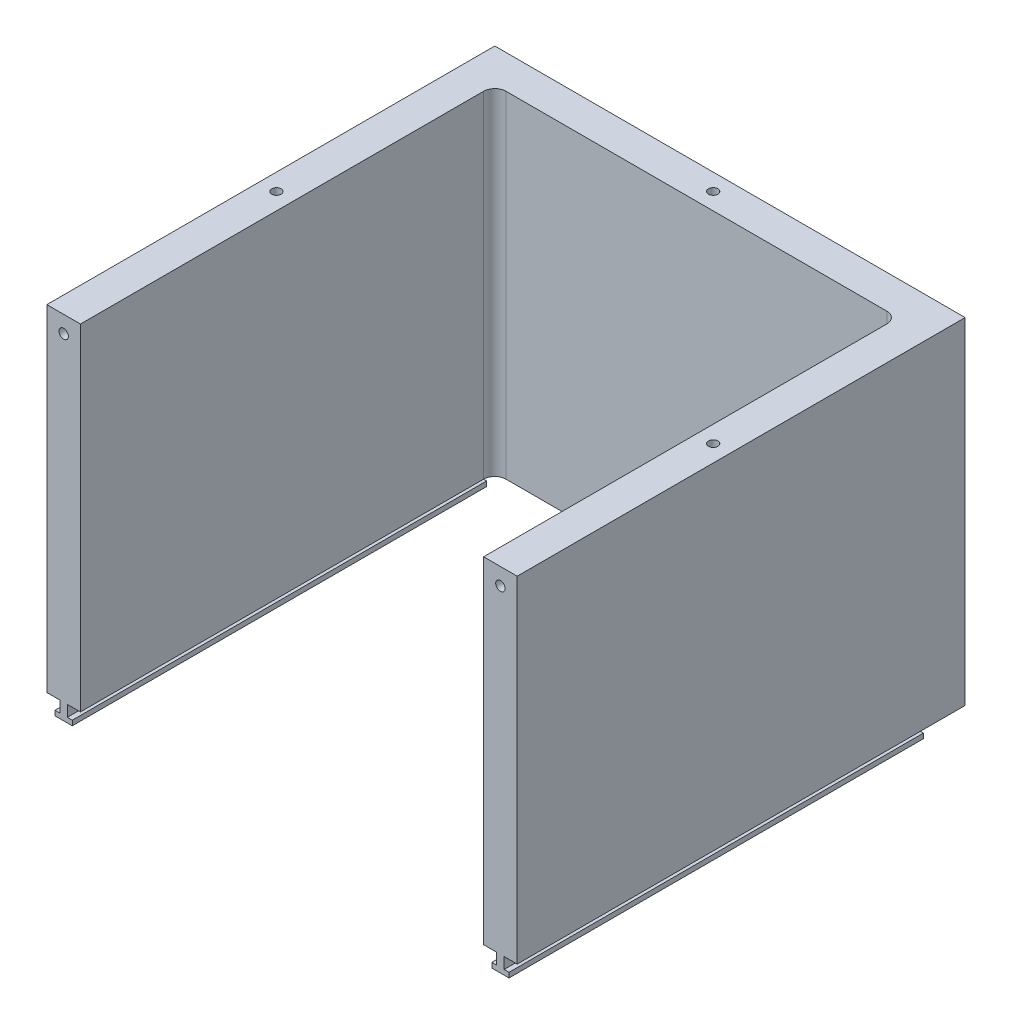
ISO-10303-21;
HEADER;
FILE_DESCRIPTION(('STEP AP214'),'2;1');
FILE_NAME('part.step','',(''),(''),'','','');
FILE_SCHEMA(('AUTOMOTIVE_DESIGN { 1 0 10303 214 1 1 1 1 }'));
ENDSEC;
DATA;
#1=APPLICATION_CONTEXT('core data for automotive mechanical design processes');
#2=APPLICATION_PROTOCOL_DEFINITION('international standard','automotive_design',2000,#1);
#3=PRODUCT_CONTEXT('',#1,'mechanical');
#4=PRODUCT('Part','Part','',(#3));
#5=PRODUCT_RELATED_PRODUCT_CATEGORY('part','',(#4));
#6=PRODUCT_DEFINITION_FORMATION('','',#4);
#7=PRODUCT_DEFINITION_CONTEXT('part definition',#1,'design');
#8=PRODUCT_DEFINITION('design','',#6,#7);
#9=PRODUCT_DEFINITION_SHAPE('','',#8);
#10=(LENGTH_UNIT() NAMED_UNIT(*) SI_UNIT(.MILLI.,.METRE.));
#11=(NAMED_UNIT(*) PLANE_ANGLE_UNIT() SI_UNIT($,.RADIAN.));
#12=(NAMED_UNIT(*) SI_UNIT($,.STERADIAN.) SOLID_ANGLE_UNIT());
#13=UNCERTAINTY_MEASURE_WITH_UNIT(LENGTH_MEASURE(1.E-05),#10,'distance_accuracy_value','');
#14=(GEOMETRIC_REPRESENTATION_CONTEXT(3) GLOBAL_UNCERTAINTY_ASSIGNED_CONTEXT((#13)) GLOBAL_UNIT_ASSIGNED_CONTEXT((#10,
#11,#12)) REPRESENTATION_CONTEXT('',''));
#15=CARTESIAN_POINT('',(0.,0.,0.));
#16=DIRECTION('',(0.,0.,1.));
#17=DIRECTION('',(1.,0.,0.));
#18=AXIS2_PLACEMENT_3D('',#15,#16,#17);
#19=CARTESIAN_POINT('',(0.,75.,0.));
#20=DIRECTION('',(0.,1.,0.));
#21=DIRECTION('',(0.,0.,1.));
#22=AXIS2_PLACEMENT_3D('',#19,#20,#21);
#23=PLANE('',#22);
#24=DIRECTION('',(0.,0.,1.));
#25=VECTOR('',#24,1.);
#26=CARTESIAN_POINT('',(-95.85,75.,-10.5418214744891));
#27=LINE('',#26,#25);
#28=CARTESIAN_POINT('',(-95.85,75.,0.));
#29=VERTEX_POINT('',#28);
#30=CARTESIAN_POINT('',(-95.85,75.,185.));
#31=VERTEX_POINT('',#30);
#32=EDGE_CURVE('E259',#29,#31,#27,.T.);
#33=ORIENTED_EDGE('',*,*,#32,.F.);
#34=DIRECTION('',(-1.,0.,0.));
#35=VECTOR('',#34,1.);
#36=CARTESIAN_POINT('',(-99.1499999999999,75.,0.));
#37=LINE('',#36,#35);
#38=CARTESIAN_POINT('',(-99.1499999999999,75.,0.));
#39=VERTEX_POINT('',#38);
#40=EDGE_CURVE('E256',#29,#39,#37,.T.);
#41=ORIENTED_EDGE('',*,*,#40,.T.);
#42=DIRECTION('',(0.,0.,1.));
#43=VECTOR('',#42,1.);
#44=CARTESIAN_POINT('',(-99.1499999999999,75.,-10.5418214744891));
#45=LINE('',#44,#43);
#46=CARTESIAN_POINT('',(-99.1499999999999,75.,185.));
#47=VERTEX_POINT('',#46);
#48=EDGE_CURVE('E255',#39,#47,#45,.T.);
#49=ORIENTED_EDGE('',*,*,#48,.T.);
#50=DIRECTION('',(1.,0.,0.));
#51=VECTOR('',#50,1.);
#52=CARTESIAN_POINT('',(-90.,75.,185.));
#53=LINE('',#52,#51);
#54=CARTESIAN_POINT('',(-105.,75.,185.));
#55=VERTEX_POINT('',#54);
#56=EDGE_CURVE('E411',#55,#47,#53,.T.);
#57=ORIENTED_EDGE('',*,*,#56,.F.);
#58=DIRECTION('',(0.,0.,1.));
#59=VECTOR('',#58,1.);
#60=CARTESIAN_POINT('',(-105.,75.,185.));
#61=LINE('',#60,#59);
#62=CARTESIAN_POINT('',(-105.,75.,-15.));
#63=VERTEX_POINT('',#62);
#64=EDGE_CURVE('E408',#63,#55,#61,.T.);
#65=ORIENTED_EDGE('',*,*,#64,.F.);
#66=DIRECTION('',(-1.,0.,0.));
#67=VECTOR('',#66,1.);
#68=CARTESIAN_POINT('',(-105.,75.,-15.));
#69=LINE('',#68,#67);
#70=CARTESIAN_POINT('',(105.,75.,-15.));
#71=VERTEX_POINT('',#70);
#72=EDGE_CURVE('E414',#71,#63,#69,.T.);
#73=ORIENTED_EDGE('',*,*,#72,.F.);
#74=DIRECTION('',(0.,0.,-1.));
#75=VECTOR('',#74,1.);
#76=CARTESIAN_POINT('',(105.,75.,-15.));
#77=LINE('',#76,#75);
#78=CARTESIAN_POINT('',(105.,75.,185.));
#79=VERTEX_POINT('',#78);
#80=EDGE_CURVE('E410',#79,#71,#77,.T.);
#81=ORIENTED_EDGE('',*,*,#80,.F.);
#82=CARTESIAN_POINT('',(99.1499999999999,75.,185.));
#83=VERTEX_POINT('',#82);
#84=EDGE_CURVE('E416',#83,#79,#53,.T.);
#85=ORIENTED_EDGE('',*,*,#84,.F.);
#86=DIRECTION('',(0.,0.,1.));
#87=VECTOR('',#86,1.);
#88=CARTESIAN_POINT('',(99.1499999999999,75.,-10.5418214744891));
#89=LINE('',#88,#87);
#90=CARTESIAN_POINT('',(99.1499999999999,75.,0.));
#91=VERTEX_POINT('',#90);
#92=EDGE_CURVE('E289',#91,#83,#89,.T.);
#93=ORIENTED_EDGE('',*,*,#92,.F.);
#94=DIRECTION('',(-1.,0.,0.));
#95=VECTOR('',#94,1.);
#96=CARTESIAN_POINT('',(99.1499999999999,75.,0.));
#97=LINE('',#96,#95);
#98=CARTESIAN_POINT('',(95.85,75.,0.));
#99=VERTEX_POINT('',#98);
#100=EDGE_CURVE('E291',#91,#99,#97,.T.);
#101=ORIENTED_EDGE('',*,*,#100,.T.);
#102=DIRECTION('',(0.,0.,1.));
#103=VECTOR('',#102,1.);
#104=CARTESIAN_POINT('',(95.85,75.,-10.5418214744891));
#105=LINE('',#104,#103);
#106=CARTESIAN_POINT('',(95.85,75.,185.));
#107=VERTEX_POINT('',#106);
#108=EDGE_CURVE('E292',#99,#107,#105,.T.);
#109=ORIENTED_EDGE('',*,*,#108,.T.);
#110=CARTESIAN_POINT('',(90.,75.,185.));
#111=VERTEX_POINT('',#110);
#112=EDGE_CURVE('E417',#111,#107,#53,.T.);
#113=ORIENTED_EDGE('',*,*,#112,.F.);
#114=DIRECTION('',(0.,0.,1.));
#115=VECTOR('',#114,1.);
#116=CARTESIAN_POINT('',(90.,75.,0.));
#117=LINE('',#116,#115);
#118=CARTESIAN_POINT('',(90.,75.,5.));
#119=VERTEX_POINT('',#118);
#120=EDGE_CURVE('E421',#119,#111,#117,.T.);
#121=ORIENTED_EDGE('',*,*,#120,.F.);
#122=CARTESIAN_POINT('',(85.,75.,5.));
#123=DIRECTION('',(0.,1.,0.));
#124=DIRECTION('',(0.,0.,1.));
#125=AXIS2_PLACEMENT_3D('',#122,#123,#124);
#126=CIRCLE('',#125,5.);
#127=CARTESIAN_POINT('',(85.,75.,0.));
#128=VERTEX_POINT('',#127);
#129=EDGE_CURVE('E436',#119,#128,#126,.T.);
#130=ORIENTED_EDGE('',*,*,#129,.T.);
#131=DIRECTION('',(1.,0.,0.));
#132=VECTOR('',#131,1.);
#133=CARTESIAN_POINT('',(-90.,75.,0.));
#134=LINE('',#133,#132);
#135=CARTESIAN_POINT('',(-85.,75.,0.));
#136=VERTEX_POINT('',#135);
#137=EDGE_CURVE('E424',#136,#128,#134,.T.);
#138=ORIENTED_EDGE('',*,*,#137,.F.);
#139=CARTESIAN_POINT('',(-85.,75.,5.));
#140=DIRECTION('',(0.,1.,0.));
#141=DIRECTION('',(0.,0.,1.));
#142=AXIS2_PLACEMENT_3D('',#139,#140,#141);
#143=CIRCLE('',#142,5.);
#144=CARTESIAN_POINT('',(-90.,75.,5.));
#145=VERTEX_POINT('',#144);
#146=EDGE_CURVE('E56',#136,#145,#143,.T.);
#147=ORIENTED_EDGE('',*,*,#146,.T.);
#148=DIRECTION('',(0.,0.,-1.));
#149=VECTOR('',#148,1.);
#150=CARTESIAN_POINT('',(-90.,75.,0.));
#151=LINE('',#150,#149);
#152=CARTESIAN_POINT('',(-90.,75.,185.));
#153=VERTEX_POINT('',#152);
#154=EDGE_CURVE('E422',#153,#145,#151,.T.);
#155=ORIENTED_EDGE('',*,*,#154,.F.);
#156=EDGE_CURVE('E415',#31,#153,#53,.T.);
#157=ORIENTED_EDGE('',*,*,#156,.F.);
#158=EDGE_LOOP('',(#33,#41,#49,#57,#65,#73,#81,#85,#93,#101,#109,#113,#121,#130,#138,#147,#155,#157));
#159=FACE_BOUND('',#158,.T.);
#160=ADVANCED_FACE('F48',(#159),#23,.F.);
#161=CARTESIAN_POINT('',(97.4999999999999,219.,90.));
#162=DIRECTION('',(0.,-1.,0.));
#163=DIRECTION('',(0.,0.,-1.));
#164=AXIS2_PLACEMENT_3D('',#161,#162,#163);
#165=PLANE('',#164);
#166=CARTESIAN_POINT('',(97.4999999999999,219.,90.));
#167=DIRECTION('',(0.,1.,0.));
#168=DIRECTION('',(0.,0.,-1.));
#169=AXIS2_PLACEMENT_3D('',#166,#167,#168);
#170=CIRCLE('',#169,2.09999999999987);
#171=CARTESIAN_POINT('',(97.4999999999999,219.,87.9000000000001));
#172=VERTEX_POINT('',#171);
#173=EDGE_CURVE('E281',#172,#172,#170,.T.);
#174=ORIENTED_EDGE('',*,*,#173,.T.);
#175=EDGE_LOOP('',(#174));
#176=FACE_BOUND('',#175,.T.);
#177=ADVANCED_FACE('F522',(#176),#165,.F.);
#178=CARTESIAN_POINT('',(-97.4999999999999,219.,90.));
#179=DIRECTION('',(0.,1.,0.));
#180=DIRECTION('',(0.,0.,1.));
#181=AXIS2_PLACEMENT_3D('',#178,#179,#180);
#182=PLANE('',#181);
#183=CARTESIAN_POINT('',(-97.4999999999999,219.,90.));
#184=DIRECTION('',(0.,1.,0.));
#185=DIRECTION('',(0.,0.,1.));
#186=AXIS2_PLACEMENT_3D('',#183,#184,#185);
#187=CIRCLE('',#186,2.1);
#188=CARTESIAN_POINT('',(-97.4999999999999,219.,92.1));
#189=VERTEX_POINT('',#188);
#190=EDGE_CURVE('E354',#189,#189,#187,.T.);
#191=ORIENTED_EDGE('',*,*,#190,.T.);
#192=EDGE_LOOP('',(#191));
#193=FACE_BOUND('',#192,.T.);
#194=ADVANCED_FACE('F529',(#193),#182,.T.);
#195=CARTESIAN_POINT('',(0.,219.,-7.50000000000006));
#196=DIRECTION('',(0.,1.,0.));
#197=DIRECTION('',(0.,0.,1.));
#198=AXIS2_PLACEMENT_3D('',#195,#196,#197);
#199=PLANE('',#198);
#200=CARTESIAN_POINT('',(0.,219.,-7.50000000000006));
#201=DIRECTION('',(0.,1.,0.));
#202=DIRECTION('',(0.,0.,1.));
#203=AXIS2_PLACEMENT_3D('',#200,#201,#202);
#204=CIRCLE('',#203,2.1);
#205=CARTESIAN_POINT('',(0.,219.,-5.40000000000006));
#206=VERTEX_POINT('',#205);
#207=EDGE_CURVE('E344',#206,#206,#204,.T.);
#208=ORIENTED_EDGE('',*,*,#207,.T.);
#209=EDGE_LOOP('',(#208));
#210=FACE_BOUND('',#209,.T.);
#211=ADVANCED_FACE('F571',(#210),#199,.T.);
#212=CARTESIAN_POINT('',(-97.4999999999999,217.5,180.5));
#213=DIRECTION('',(0.,0.,1.));
#214=DIRECTION('',(1.,0.,0.));
#215=AXIS2_PLACEMENT_3D('',#212,#213,#214);
#216=PLANE('',#215);
#217=CARTESIAN_POINT('',(-97.4999999999999,217.5,180.5));
#218=DIRECTION('',(0.,0.,1.));
#219=DIRECTION('',(1.,0.,0.));
#220=AXIS2_PLACEMENT_3D('',#217,#218,#219);
#221=CIRCLE('',#220,2.1);
#222=CARTESIAN_POINT('',(-95.3999999999999,217.5,180.5));
#223=VERTEX_POINT('',#222);
#224=EDGE_CURVE('E347',#223,#223,#221,.T.);
#225=ORIENTED_EDGE('',*,*,#224,.T.);
#226=EDGE_LOOP('',(#225));
#227=FACE_BOUND('',#226,.T.);
#228=ADVANCED_FACE('F567',(#227),#216,.T.);
#229=CARTESIAN_POINT('',(97.4999999999999,217.5,180.5));
#230=DIRECTION('',(0.,0.,-1.));
#231=DIRECTION('',(-1.,0.,0.));
#232=AXIS2_PLACEMENT_3D('',#229,#230,#231);
#233=PLANE('',#232);
#234=CARTESIAN_POINT('',(97.4999999999999,217.5,180.5));
#235=DIRECTION('',(0.,0.,-1.));
#236=DIRECTION('',(-1.,0.,0.));
#237=AXIS2_PLACEMENT_3D('',#234,#235,#236);
#238=CIRCLE('',#237,2.1);
#239=CARTESIAN_POINT('',(95.3999999999999,217.5,180.5));
#240=VERTEX_POINT('',#239);
#241=EDGE_CURVE('E366',#240,#240,#238,.T.);
#242=ORIENTED_EDGE('',*,*,#241,.F.);
#243=EDGE_LOOP('',(#242));
#244=FACE_BOUND('',#243,.T.);
#245=ADVANCED_FACE('F565',(#244),#233,.F.);
#246=CARTESIAN_POINT('',(97.4999999999999,219.,90.));
#247=DIRECTION('',(0.,1.,0.));
#248=DIRECTION('',(0.,0.,1.));
#249=AXIS2_PLACEMENT_3D('',#246,#247,#248);
#250=CYLINDRICAL_SURFACE('',#249,2.09999999999987);
#251=ORIENTED_EDGE('',*,*,#173,.F.);
#252=EDGE_LOOP('',(#251));
#253=FACE_BOUND('',#252,.T.);
#254=CARTESIAN_POINT('',(97.4999999999999,225.,90.));
#255=DIRECTION('',(0.,1.,0.));
#256=DIRECTION('',(0.,0.,-1.));
#257=AXIS2_PLACEMENT_3D('',#254,#255,#256);
#258=CIRCLE('',#257,2.09999999999987);
#259=CARTESIAN_POINT('',(97.4999999999999,225.,87.9000000000001));
#260=VERTEX_POINT('',#259);
#261=EDGE_CURVE('E357',#260,#260,#258,.T.);
#262=ORIENTED_EDGE('',*,*,#261,.T.);
#263=EDGE_LOOP('',(#262));
#264=FACE_BOUND('',#263,.T.);
#265=ADVANCED_FACE('F566',(#253,#264),#250,.F.);
#266=CARTESIAN_POINT('',(-97.4999999999999,219.,90.));
#267=DIRECTION('',(0.,1.,0.));
#268=DIRECTION('',(0.,0.,1.));
#269=AXIS2_PLACEMENT_3D('',#266,#267,#268);
#270=CYLINDRICAL_SURFACE('',#269,2.1);
#271=ORIENTED_EDGE('',*,*,#190,.F.);
#272=EDGE_LOOP('',(#271));
#273=FACE_BOUND('',#272,.T.);
#274=CARTESIAN_POINT('',(-97.4999999999999,225.,90.));
#275=DIRECTION('',(0.,1.,0.));
#276=DIRECTION('',(0.,0.,1.));
#277=AXIS2_PLACEMENT_3D('',#274,#275,#276);
#278=CIRCLE('',#277,2.1);
#279=CARTESIAN_POINT('',(-97.4999999999999,225.,92.1));
#280=VERTEX_POINT('',#279);
#281=EDGE_CURVE('E351',#280,#280,#278,.T.);
#282=ORIENTED_EDGE('',*,*,#281,.T.);
#283=EDGE_LOOP('',(#282));
#284=FACE_BOUND('',#283,.T.);
#285=ADVANCED_FACE('F735',(#273,#284),#270,.F.);
#286=CARTESIAN_POINT('',(0.,219.,-7.50000000000006));
#287=DIRECTION('',(0.,1.,0.));
#288=DIRECTION('',(0.,0.,1.));
#289=AXIS2_PLACEMENT_3D('',#286,#287,#288);
#290=CYLINDRICAL_SURFACE('',#289,2.1);
#291=ORIENTED_EDGE('',*,*,#207,.F.);
#292=EDGE_LOOP('',(#291));
#293=FACE_BOUND('',#292,.T.);
#294=CARTESIAN_POINT('',(0.,225.,-7.50000000000006));
#295=DIRECTION('',(0.,1.,0.));
#296=DIRECTION('',(0.,0.,1.));
#297=AXIS2_PLACEMENT_3D('',#294,#295,#296);
#298=CIRCLE('',#297,2.1);
#299=CARTESIAN_POINT('',(0.,225.,-5.40000000000006));
#300=VERTEX_POINT('',#299);
#301=EDGE_CURVE('E348',#300,#300,#298,.T.);
#302=ORIENTED_EDGE('',*,*,#301,.T.);
#303=EDGE_LOOP('',(#302));
#304=FACE_BOUND('',#303,.T.);
#305=ADVANCED_FACE('F559',(#293,#304),#290,.F.);
#306=CARTESIAN_POINT('',(-97.4999999999999,217.5,180.5));
#307=DIRECTION('',(0.,0.,1.));
#308=DIRECTION('',(1.,0.,0.));
#309=AXIS2_PLACEMENT_3D('',#306,#307,#308);
#310=CYLINDRICAL_SURFACE('',#309,2.1);
#311=ORIENTED_EDGE('',*,*,#224,.F.);
#312=EDGE_LOOP('',(#311));
#313=FACE_BOUND('',#312,.T.);
#314=CARTESIAN_POINT('',(-97.4999999999999,217.5,185.));
#315=DIRECTION('',(0.,0.,1.));
#316=DIRECTION('',(1.,0.,0.));
#317=AXIS2_PLACEMENT_3D('',#314,#315,#316);
#318=CIRCLE('',#317,2.1);
#319=CARTESIAN_POINT('',(-95.3999999999999,217.5,185.));
#320=VERTEX_POINT('',#319);
#321=EDGE_CURVE('E369',#320,#320,#318,.T.);
#322=ORIENTED_EDGE('',*,*,#321,.T.);
#323=EDGE_LOOP('',(#322));
#324=FACE_BOUND('',#323,.T.);
#325=ADVANCED_FACE('F551',(#313,#324),#310,.F.);
#326=CARTESIAN_POINT('',(97.4999999999999,217.5,180.5));
#327=DIRECTION('',(0.,0.,1.));
#328=DIRECTION('',(1.,0.,0.));
#329=AXIS2_PLACEMENT_3D('',#326,#327,#328);
#330=CYLINDRICAL_SURFACE('',#329,2.1);
#331=ORIENTED_EDGE('',*,*,#241,.T.);
#332=EDGE_LOOP('',(#331));
#333=FACE_BOUND('',#332,.T.);
#334=CARTESIAN_POINT('',(97.4999999999999,217.5,185.));
#335=DIRECTION('',(0.,0.,-1.));
#336=DIRECTION('',(-1.,0.,0.));
#337=AXIS2_PLACEMENT_3D('',#334,#335,#336);
#338=CIRCLE('',#337,2.1);
#339=CARTESIAN_POINT('',(95.3999999999999,217.5,185.));
#340=VERTEX_POINT('',#339);
#341=EDGE_CURVE('E362',#340,#340,#338,.T.);
#342=ORIENTED_EDGE('',*,*,#341,.F.);
#343=EDGE_LOOP('',(#342));
#344=FACE_BOUND('',#343,.T.);
#345=ADVANCED_FACE('F544',(#333,#344),#330,.F.);
#346=CARTESIAN_POINT('',(-90.,225.,0.));
#347=DIRECTION('',(-1.,0.,0.));
#348=DIRECTION('',(0.,0.,1.));
#349=AXIS2_PLACEMENT_3D('',#346,#347,#348);
#350=PLANE('',#349);
#351=ORIENTED_EDGE('',*,*,#154,.T.);
#352=DIRECTION('',(0.,-1.,0.));
#353=VECTOR('',#352,1.);
#354=CARTESIAN_POINT('',(-90.,225.,5.));
#355=LINE('',#354,#353);
#356=CARTESIAN_POINT('',(-90.,225.,5.));
#357=VERTEX_POINT('',#356);
#358=EDGE_CURVE('E63',#145,#357,#355,.F.);
#359=ORIENTED_EDGE('',*,*,#358,.T.);
#360=DIRECTION('',(0.,0.,-1.));
#361=VECTOR('',#360,1.);
#362=CARTESIAN_POINT('',(-90.,225.,0.));
#363=LINE('',#362,#361);
#364=CARTESIAN_POINT('',(-90.,225.,185.));
#365=VERTEX_POINT('',#364);
#366=EDGE_CURVE('E365',#365,#357,#363,.T.);
#367=ORIENTED_EDGE('',*,*,#366,.F.);
#368=DIRECTION('',(0.,-1.,0.));
#369=VECTOR('',#368,1.);
#370=CARTESIAN_POINT('',(-90.,225.,185.));
#371=LINE('',#370,#369);
#372=EDGE_CURVE('E390',#365,#153,#371,.T.);
#373=ORIENTED_EDGE('',*,*,#372,.T.);
#374=EDGE_LOOP('',(#351,#359,#367,#373));
#375=FACE_BOUND('',#374,.T.);
#376=ADVANCED_FACE('F462',(#375),#350,.F.);
#377=CARTESIAN_POINT('',(0.,225.,0.));
#378=DIRECTION('',(0.,-1.,0.));
#379=DIRECTION('',(0.,0.,-1.));
#380=AXIS2_PLACEMENT_3D('',#377,#378,#379);
#381=PLANE('',#380);
#382=ORIENTED_EDGE('',*,*,#301,.F.);
#383=EDGE_LOOP('',(#382));
#384=FACE_BOUND('',#383,.T.);
#385=ORIENTED_EDGE('',*,*,#281,.F.);
#386=EDGE_LOOP('',(#385));
#387=FACE_BOUND('',#386,.T.);
#388=ORIENTED_EDGE('',*,*,#261,.F.);
#389=EDGE_LOOP('',(#388));
#390=FACE_BOUND('',#389,.T.);
#391=ORIENTED_EDGE('',*,*,#366,.T.);
#392=CARTESIAN_POINT('',(-85.,225.,5.));
#393=DIRECTION('',(0.,-1.,0.));
#394=DIRECTION('',(0.,0.,-1.));
#395=AXIS2_PLACEMENT_3D('',#392,#393,#394);
#396=CIRCLE('',#395,5.);
#397=CARTESIAN_POINT('',(-85.,225.,0.));
#398=VERTEX_POINT('',#397);
#399=EDGE_CURVE('E12',#357,#398,#396,.T.);
#400=ORIENTED_EDGE('',*,*,#399,.T.);
#401=DIRECTION('',(1.,0.,0.));
#402=VECTOR('',#401,1.);
#403=CARTESIAN_POINT('',(-90.,225.,0.));
#404=LINE('',#403,#402);
#405=CARTESIAN_POINT('',(84.9999999999999,225.,0.));
#406=VERTEX_POINT('',#405);
#407=EDGE_CURVE('E375',#398,#406,#404,.T.);
#408=ORIENTED_EDGE('',*,*,#407,.T.);
#409=CARTESIAN_POINT('',(85.,225.,5.));
#410=DIRECTION('',(0.,-1.,0.));
#411=DIRECTION('',(0.,0.,-1.));
#412=AXIS2_PLACEMENT_3D('',#409,#410,#411);
#413=CIRCLE('',#412,5.);
#414=CARTESIAN_POINT('',(90.,225.,5.));
#415=VERTEX_POINT('',#414);
#416=EDGE_CURVE('E438',#406,#415,#413,.T.);
#417=ORIENTED_EDGE('',*,*,#416,.T.);
#418=DIRECTION('',(0.,0.,1.));
#419=VECTOR('',#418,1.);
#420=CARTESIAN_POINT('',(90.,225.,0.));
#421=LINE('',#420,#419);
#422=CARTESIAN_POINT('',(90.,225.,185.));
#423=VERTEX_POINT('',#422);
#424=EDGE_CURVE('E378',#415,#423,#421,.T.);
#425=ORIENTED_EDGE('',*,*,#424,.T.);
#426=DIRECTION('',(1.,0.,0.));
#427=VECTOR('',#426,1.);
#428=CARTESIAN_POINT('',(105.,225.,185.));
#429=LINE('',#428,#427);
#430=CARTESIAN_POINT('',(105.,225.,185.));
#431=VERTEX_POINT('',#430);
#432=EDGE_CURVE('E380',#423,#431,#429,.T.);
#433=ORIENTED_EDGE('',*,*,#432,.T.);
#434=DIRECTION('',(0.,0.,-1.));
#435=VECTOR('',#434,1.);
#436=CARTESIAN_POINT('',(105.,225.,-15.));
#437=LINE('',#436,#435);
#438=CARTESIAN_POINT('',(105.,225.,-15.));
#439=VERTEX_POINT('',#438);
#440=EDGE_CURVE('E382',#431,#439,#437,.T.);
#441=ORIENTED_EDGE('',*,*,#440,.T.);
#442=DIRECTION('',(-1.,0.,0.));
#443=VECTOR('',#442,1.);
#444=CARTESIAN_POINT('',(-105.,225.,-15.));
#445=LINE('',#444,#443);
#446=CARTESIAN_POINT('',(-105.,225.,-15.));
#447=VERTEX_POINT('',#446);
#448=EDGE_CURVE('E384',#439,#447,#445,.T.);
#449=ORIENTED_EDGE('',*,*,#448,.T.);
#450=DIRECTION('',(0.,0.,1.));
#451=VECTOR('',#450,1.);
#452=CARTESIAN_POINT('',(-105.,225.,185.));
#453=LINE('',#452,#451);
#454=CARTESIAN_POINT('',(-105.,225.,185.));
#455=VERTEX_POINT('',#454);
#456=EDGE_CURVE('E386',#447,#455,#453,.T.);
#457=ORIENTED_EDGE('',*,*,#456,.T.);
#458=DIRECTION('',(1.,0.,0.));
#459=VECTOR('',#458,1.);
#460=CARTESIAN_POINT('',(-90.,225.,185.));
#461=LINE('',#460,#459);
#462=EDGE_CURVE('E388',#455,#365,#461,.T.);
#463=ORIENTED_EDGE('',*,*,#462,.T.);
#464=EDGE_LOOP('',(#391,#400,#408,#417,#425,#433,#441,#449,#457,#463));
#465=FACE_BOUND('',#464,.T.);
#466=ADVANCED_FACE('F442',(#384,#387,#390,#465),#381,.F.);
#467=CARTESIAN_POINT('',(-90.,225.,185.));
#468=DIRECTION('',(0.,0.,-1.));
#469=DIRECTION('',(-1.,0.,0.));
#470=AXIS2_PLACEMENT_3D('',#467,#468,#469);
#471=PLANE('',#470);
#472=ORIENTED_EDGE('',*,*,#321,.F.);
#473=EDGE_LOOP('',(#472));
#474=FACE_BOUND('',#473,.T.);
#475=DIRECTION('',(0.,-1.,0.));
#476=VECTOR('',#475,1.);
#477=CARTESIAN_POINT('',(-105.,225.,185.));
#478=LINE('',#477,#476);
#479=EDGE_CURVE('E393',#455,#55,#478,.T.);
#480=ORIENTED_EDGE('',*,*,#479,.T.);
#481=ORIENTED_EDGE('',*,*,#56,.T.);
#482=DIRECTION('',(0.,-1.,0.));
#483=VECTOR('',#482,1.);
#484=CARTESIAN_POINT('',(-99.1499999999999,70.,185.));
#485=LINE('',#484,#483);
#486=CARTESIAN_POINT('',(-99.1499999999999,70.,185.));
#487=VERTEX_POINT('',#486);
#488=EDGE_CURVE('E251',#47,#487,#485,.T.);
#489=ORIENTED_EDGE('',*,*,#488,.T.);
#490=DIRECTION('',(-1.,0.,0.));
#491=VECTOR('',#490,1.);
#492=CARTESIAN_POINT('',(-101.35,70.,185.));
#493=LINE('',#492,#491);
#494=CARTESIAN_POINT('',(-101.35,70.,185.));
#495=VERTEX_POINT('',#494);
#496=EDGE_CURVE('E594',#487,#495,#493,.T.);
#497=ORIENTED_EDGE('',*,*,#496,.T.);
#498=DIRECTION('',(0.,-1.,0.));
#499=VECTOR('',#498,1.);
#500=CARTESIAN_POINT('',(-101.35,67.8,185.));
#501=LINE('',#500,#499);
#502=CARTESIAN_POINT('',(-101.35,67.8,185.));
#503=VERTEX_POINT('',#502);
#504=EDGE_CURVE('E236',#495,#503,#501,.T.);
#505=ORIENTED_EDGE('',*,*,#504,.T.);
#506=DIRECTION('',(1.,0.,0.));
#507=VECTOR('',#506,1.);
#508=CARTESIAN_POINT('',(-93.6499999999999,67.8,185.));
#509=LINE('',#508,#507);
#510=CARTESIAN_POINT('',(-93.6499999999999,67.8,185.));
#511=VERTEX_POINT('',#510);
#512=EDGE_CURVE('E595',#503,#511,#509,.T.);
#513=ORIENTED_EDGE('',*,*,#512,.T.);
#514=DIRECTION('',(0.,1.,0.));
#515=VECTOR('',#514,1.);
#516=CARTESIAN_POINT('',(-93.6499999999999,70.,185.));
#517=LINE('',#516,#515);
#518=CARTESIAN_POINT('',(-93.6499999999999,70.,185.));
#519=VERTEX_POINT('',#518);
#520=EDGE_CURVE('E600',#511,#519,#517,.T.);
#521=ORIENTED_EDGE('',*,*,#520,.T.);
#522=DIRECTION('',(-1.,0.,0.));
#523=VECTOR('',#522,1.);
#524=CARTESIAN_POINT('',(-95.85,70.,185.));
#525=LINE('',#524,#523);
#526=CARTESIAN_POINT('',(-95.85,70.,185.));
#527=VERTEX_POINT('',#526);
#528=EDGE_CURVE('E247',#519,#527,#525,.T.);
#529=ORIENTED_EDGE('',*,*,#528,.T.);
#530=DIRECTION('',(0.,1.,0.));
#531=VECTOR('',#530,1.);
#532=CARTESIAN_POINT('',(-95.85,75.,185.));
#533=LINE('',#532,#531);
#534=EDGE_CURVE('E244',#527,#31,#533,.T.);
#535=ORIENTED_EDGE('',*,*,#534,.T.);
#536=ORIENTED_EDGE('',*,*,#156,.T.);
#537=ORIENTED_EDGE('',*,*,#372,.F.);
#538=ORIENTED_EDGE('',*,*,#462,.F.);
#539=EDGE_LOOP('',(#480,#481,#489,#497,#505,#513,#521,#529,#535,#536,#537,#538));
#540=FACE_BOUND('',#539,.T.);
#541=ADVANCED_FACE('F464',(#474,#540),#471,.F.);
#542=CARTESIAN_POINT('',(-105.,225.,-15.));
#543=DIRECTION('',(0.,0.,1.));
#544=DIRECTION('',(1.,0.,0.));
#545=AXIS2_PLACEMENT_3D('',#542,#543,#544);
#546=PLANE('',#545);
#547=DIRECTION('',(0.,-1.,0.));
#548=VECTOR('',#547,1.);
#549=CARTESIAN_POINT('',(105.,225.,-15.));
#550=LINE('',#549,#548);
#551=EDGE_CURVE('E399',#439,#71,#550,.T.);
#552=ORIENTED_EDGE('',*,*,#551,.T.);
#553=ORIENTED_EDGE('',*,*,#72,.T.);
#554=DIRECTION('',(0.,-1.,0.));
#555=VECTOR('',#554,1.);
#556=CARTESIAN_POINT('',(-105.,225.,-15.));
#557=LINE('',#556,#555);
#558=EDGE_CURVE('E396',#447,#63,#557,.T.);
#559=ORIENTED_EDGE('',*,*,#558,.F.);
#560=ORIENTED_EDGE('',*,*,#448,.F.);
#561=EDGE_LOOP('',(#552,#553,#559,#560));
#562=FACE_BOUND('',#561,.T.);
#563=ADVANCED_FACE('F578',(#562),#546,.F.);
#564=CARTESIAN_POINT('',(-105.,225.,185.));
#565=DIRECTION('',(1.,0.,0.));
#566=DIRECTION('',(0.,0.,-1.));
#567=AXIS2_PLACEMENT_3D('',#564,#565,#566);
#568=PLANE('',#567);
#569=ORIENTED_EDGE('',*,*,#558,.T.);
#570=ORIENTED_EDGE('',*,*,#64,.T.);
#571=ORIENTED_EDGE('',*,*,#479,.F.);
#572=ORIENTED_EDGE('',*,*,#456,.F.);
#573=EDGE_LOOP('',(#569,#570,#571,#572));
#574=FACE_BOUND('',#573,.T.);
#575=ADVANCED_FACE('F576',(#574),#568,.F.);
#576=DIRECTION('',(0.,-1.,0.));
#577=VECTOR('',#576,1.);
#578=CARTESIAN_POINT('',(90.,225.,185.));
#579=LINE('',#578,#577);
#580=EDGE_CURVE('E405',#423,#111,#579,.T.);
#581=ORIENTED_EDGE('',*,*,#580,.T.);
#582=ORIENTED_EDGE('',*,*,#112,.T.);
#583=DIRECTION('',(0.,-1.,0.));
#584=VECTOR('',#583,1.);
#585=CARTESIAN_POINT('',(95.85,75.,185.));
#586=LINE('',#585,#584);
#587=CARTESIAN_POINT('',(95.85,70.,185.));
#588=VERTEX_POINT('',#587);
#589=EDGE_CURVE('E333',#107,#588,#586,.T.);
#590=ORIENTED_EDGE('',*,*,#589,.T.);
#591=DIRECTION('',(-1.,0.,0.));
#592=VECTOR('',#591,1.);
#593=CARTESIAN_POINT('',(95.85,70.,185.));
#594=LINE('',#593,#592);
#595=CARTESIAN_POINT('',(93.6499999999999,70.,185.));
#596=VERTEX_POINT('',#595);
#597=EDGE_CURVE('E336',#588,#596,#594,.T.);
#598=ORIENTED_EDGE('',*,*,#597,.T.);
#599=DIRECTION('',(0.,-1.,0.));
#600=VECTOR('',#599,1.);
#601=CARTESIAN_POINT('',(93.6499999999999,70.,185.));
#602=LINE('',#601,#600);
#603=CARTESIAN_POINT('',(93.6499999999999,67.8,185.));
#604=VERTEX_POINT('',#603);
#605=EDGE_CURVE('E339',#596,#604,#602,.T.);
#606=ORIENTED_EDGE('',*,*,#605,.T.);
#607=DIRECTION('',(1.,0.,0.));
#608=VECTOR('',#607,1.);
#609=CARTESIAN_POINT('',(93.6499999999999,67.8,185.));
#610=LINE('',#609,#608);
#611=CARTESIAN_POINT('',(101.35,67.8,185.));
#612=VERTEX_POINT('',#611);
#613=EDGE_CURVE('E323',#604,#612,#610,.T.);
#614=ORIENTED_EDGE('',*,*,#613,.T.);
#615=DIRECTION('',(0.,1.,0.));
#616=VECTOR('',#615,1.);
#617=CARTESIAN_POINT('',(101.35,67.8,185.));
#618=LINE('',#617,#616);
#619=CARTESIAN_POINT('',(101.35,70.,185.));
#620=VERTEX_POINT('',#619);
#621=EDGE_CURVE('E324',#612,#620,#618,.T.);
#622=ORIENTED_EDGE('',*,*,#621,.T.);
#623=DIRECTION('',(-1.,0.,0.));
#624=VECTOR('',#623,1.);
#625=CARTESIAN_POINT('',(101.35,70.,185.));
#626=LINE('',#625,#624);
#627=CARTESIAN_POINT('',(99.1499999999999,70.,185.));
#628=VERTEX_POINT('',#627);
#629=EDGE_CURVE('E327',#620,#628,#626,.T.);
#630=ORIENTED_EDGE('',*,*,#629,.T.);
#631=DIRECTION('',(0.,1.,0.));
#632=VECTOR('',#631,1.);
#633=CARTESIAN_POINT('',(99.1499999999999,70.,185.));
#634=LINE('',#633,#632);
#635=EDGE_CURVE('E330',#628,#83,#634,.T.);
#636=ORIENTED_EDGE('',*,*,#635,.T.);
#637=ORIENTED_EDGE('',*,*,#84,.T.);
#638=DIRECTION('',(0.,-1.,0.));
#639=VECTOR('',#638,1.);
#640=CARTESIAN_POINT('',(105.,225.,185.));
#641=LINE('',#640,#639);
#642=EDGE_CURVE('E402',#431,#79,#641,.T.);
#643=ORIENTED_EDGE('',*,*,#642,.F.);
#644=ORIENTED_EDGE('',*,*,#432,.F.);
#645=EDGE_LOOP('',(#581,#582,#590,#598,#606,#614,#622,#630,#636,#637,#643,#644));
#646=FACE_BOUND('',#645,.T.);
#647=ORIENTED_EDGE('',*,*,#341,.T.);
#648=EDGE_LOOP('',(#647));
#649=FACE_BOUND('',#648,.T.);
#650=ADVANCED_FACE('F473',(#646,#649),#471,.F.);
#651=CARTESIAN_POINT('',(105.,225.,-15.));
#652=DIRECTION('',(-1.,0.,0.));
#653=DIRECTION('',(0.,0.,1.));
#654=AXIS2_PLACEMENT_3D('',#651,#652,#653);
#655=PLANE('',#654);
#656=ORIENTED_EDGE('',*,*,#642,.T.);
#657=ORIENTED_EDGE('',*,*,#80,.T.);
#658=ORIENTED_EDGE('',*,*,#551,.F.);
#659=ORIENTED_EDGE('',*,*,#440,.F.);
#660=EDGE_LOOP('',(#656,#657,#658,#659));
#661=FACE_BOUND('',#660,.T.);
#662=ADVANCED_FACE('F482',(#661),#655,.F.);
#663=CARTESIAN_POINT('',(-90.,225.,0.));
#664=DIRECTION('',(0.,0.,-1.));
#665=DIRECTION('',(-1.,0.,0.));
#666=AXIS2_PLACEMENT_3D('',#663,#664,#665);
#667=PLANE('',#666);
#668=ORIENTED_EDGE('',*,*,#137,.T.);
#669=DIRECTION('',(0.,-1.,0.));
#670=VECTOR('',#669,1.);
#671=CARTESIAN_POINT('',(85.,225.,0.));
#672=LINE('',#671,#670);
#673=EDGE_CURVE('E433',#128,#406,#672,.F.);
#674=ORIENTED_EDGE('',*,*,#673,.T.);
#675=ORIENTED_EDGE('',*,*,#407,.F.);
#676=DIRECTION('',(0.,-1.,0.));
#677=VECTOR('',#676,1.);
#678=CARTESIAN_POINT('',(-85.,75.,0.));
#679=LINE('',#678,#677);
#680=EDGE_CURVE('E430',#398,#136,#679,.T.);
#681=ORIENTED_EDGE('',*,*,#680,.T.);
#682=EDGE_LOOP('',(#668,#674,#675,#681));
#683=FACE_BOUND('',#682,.T.);
#684=ADVANCED_FACE('F456',(#683),#667,.F.);
#685=CARTESIAN_POINT('',(90.,225.,0.));
#686=DIRECTION('',(1.,0.,0.));
#687=DIRECTION('',(0.,0.,-1.));
#688=AXIS2_PLACEMENT_3D('',#685,#686,#687);
#689=PLANE('',#688);
#690=ORIENTED_EDGE('',*,*,#424,.F.);
#691=DIRECTION('',(0.,-1.,0.));
#692=VECTOR('',#691,1.);
#693=CARTESIAN_POINT('',(90.,75.,5.));
#694=LINE('',#693,#692);
#695=EDGE_CURVE('E419',#415,#119,#694,.T.);
#696=ORIENTED_EDGE('',*,*,#695,.T.);
#697=ORIENTED_EDGE('',*,*,#120,.T.);
#698=ORIENTED_EDGE('',*,*,#580,.F.);
#699=EDGE_LOOP('',(#690,#696,#697,#698));
#700=FACE_BOUND('',#699,.T.);
#701=ADVANCED_FACE('F449',(#700),#689,.F.);
#702=CARTESIAN_POINT('',(-90.,225.,0.));
#703=DIRECTION('',(0.,0.,-1.));
#704=DIRECTION('',(-1.,0.,0.));
#705=AXIS2_PLACEMENT_3D('',#702,#703,#704);
#706=PLANE('',#705);
#707=DIRECTION('',(0.,1.,0.));
#708=VECTOR('',#707,1.);
#709=CARTESIAN_POINT('',(101.35,67.8,0.));
#710=LINE('',#709,#708);
#711=CARTESIAN_POINT('',(101.35,67.8,0.));
#712=VERTEX_POINT('',#711);
#713=CARTESIAN_POINT('',(101.35,70.,0.));
#714=VERTEX_POINT('',#713);
#715=EDGE_CURVE('E284',#712,#714,#710,.T.);
#716=ORIENTED_EDGE('',*,*,#715,.F.);
#717=DIRECTION('',(1.,0.,0.));
#718=VECTOR('',#717,1.);
#719=CARTESIAN_POINT('',(93.6499999999999,67.8,0.));
#720=LINE('',#719,#718);
#721=CARTESIAN_POINT('',(93.6499999999999,67.8,0.));
#722=VERTEX_POINT('',#721);
#723=EDGE_CURVE('E304',#722,#712,#720,.T.);
#724=ORIENTED_EDGE('',*,*,#723,.F.);
#725=DIRECTION('',(0.,-1.,0.));
#726=VECTOR('',#725,1.);
#727=CARTESIAN_POINT('',(93.6499999999999,70.,0.));
#728=LINE('',#727,#726);
#729=CARTESIAN_POINT('',(93.6499999999999,70.,0.));
#730=VERTEX_POINT('',#729);
#731=EDGE_CURVE('E301',#730,#722,#728,.T.);
#732=ORIENTED_EDGE('',*,*,#731,.F.);
#733=DIRECTION('',(-1.,0.,0.));
#734=VECTOR('',#733,1.);
#735=CARTESIAN_POINT('',(95.85,70.,0.));
#736=LINE('',#735,#734);
#737=CARTESIAN_POINT('',(95.85,70.,0.));
#738=VERTEX_POINT('',#737);
#739=EDGE_CURVE('E298',#738,#730,#736,.T.);
#740=ORIENTED_EDGE('',*,*,#739,.F.);
#741=DIRECTION('',(0.,-1.,0.));
#742=VECTOR('',#741,1.);
#743=CARTESIAN_POINT('',(95.85,75.,0.));
#744=LINE('',#743,#742);
#745=EDGE_CURVE('E295',#99,#738,#744,.T.);
#746=ORIENTED_EDGE('',*,*,#745,.F.);
#747=ORIENTED_EDGE('',*,*,#100,.F.);
#748=DIRECTION('',(0.,1.,0.));
#749=VECTOR('',#748,1.);
#750=CARTESIAN_POINT('',(99.1499999999999,70.,0.));
#751=LINE('',#750,#749);
#752=CARTESIAN_POINT('',(99.1499999999999,70.,0.));
#753=VERTEX_POINT('',#752);
#754=EDGE_CURVE('E288',#753,#91,#751,.T.);
#755=ORIENTED_EDGE('',*,*,#754,.F.);
#756=DIRECTION('',(-1.,0.,0.));
#757=VECTOR('',#756,1.);
#758=CARTESIAN_POINT('',(101.35,70.,0.));
#759=LINE('',#758,#757);
#760=EDGE_CURVE('E287',#714,#753,#759,.T.);
#761=ORIENTED_EDGE('',*,*,#760,.F.);
#762=EDGE_LOOP('',(#716,#724,#732,#740,#746,#747,#755,#761));
#763=FACE_BOUND('',#762,.T.);
#764=ADVANCED_FACE('F511',(#763),#706,.T.);
#765=CARTESIAN_POINT('',(101.35,70.,-10.5418214744891));
#766=DIRECTION('',(0.,1.,0.));
#767=DIRECTION('',(0.,0.,1.));
#768=AXIS2_PLACEMENT_3D('',#765,#766,#767);
#769=PLANE('',#768);
#770=DIRECTION('',(0.,0.,1.));
#771=VECTOR('',#770,1.);
#772=CARTESIAN_POINT('',(101.35,70.,-10.5418214744891));
#773=LINE('',#772,#771);
#774=EDGE_CURVE('E282',#714,#620,#773,.T.);
#775=ORIENTED_EDGE('',*,*,#774,.F.);
#776=ORIENTED_EDGE('',*,*,#760,.T.);
#777=DIRECTION('',(0.,0.,1.));
#778=VECTOR('',#777,1.);
#779=CARTESIAN_POINT('',(99.1499999999999,70.,-10.5418214744891));
#780=LINE('',#779,#778);
#781=EDGE_CURVE('E285',#753,#628,#780,.T.);
#782=ORIENTED_EDGE('',*,*,#781,.T.);
#783=ORIENTED_EDGE('',*,*,#629,.F.);
#784=EDGE_LOOP('',(#775,#776,#782,#783));
#785=FACE_BOUND('',#784,.T.);
#786=ADVANCED_FACE('F506',(#785),#769,.T.);
#787=CARTESIAN_POINT('',(99.1499999999999,70.,-10.5418214744891));
#788=DIRECTION('',(1.,0.,0.));
#789=DIRECTION('',(0.,0.,-1.));
#790=AXIS2_PLACEMENT_3D('',#787,#788,#789);
#791=PLANE('',#790);
#792=ORIENTED_EDGE('',*,*,#781,.F.);
#793=ORIENTED_EDGE('',*,*,#754,.T.);
#794=ORIENTED_EDGE('',*,*,#92,.T.);
#795=ORIENTED_EDGE('',*,*,#635,.F.);
#796=EDGE_LOOP('',(#792,#793,#794,#795));
#797=FACE_BOUND('',#796,.T.);
#798=ADVANCED_FACE('F509',(#797),#791,.T.);
#799=CARTESIAN_POINT('',(95.85,75.,-10.5418214744891));
#800=DIRECTION('',(-1.,0.,0.));
#801=DIRECTION('',(0.,0.,1.));
#802=AXIS2_PLACEMENT_3D('',#799,#800,#801);
#803=PLANE('',#802);
#804=ORIENTED_EDGE('',*,*,#108,.F.);
#805=ORIENTED_EDGE('',*,*,#745,.T.);
#806=DIRECTION('',(0.,0.,1.));
#807=VECTOR('',#806,1.);
#808=CARTESIAN_POINT('',(95.85,70.,-10.5418214744891));
#809=LINE('',#808,#807);
#810=EDGE_CURVE('E296',#738,#588,#809,.T.);
#811=ORIENTED_EDGE('',*,*,#810,.T.);
#812=ORIENTED_EDGE('',*,*,#589,.F.);
#813=EDGE_LOOP('',(#804,#805,#811,#812));
#814=FACE_BOUND('',#813,.T.);
#815=ADVANCED_FACE('F487',(#814),#803,.T.);
#816=CARTESIAN_POINT('',(95.85,70.,-10.5418214744891));
#817=DIRECTION('',(0.,1.,0.));
#818=DIRECTION('',(0.,0.,1.));
#819=AXIS2_PLACEMENT_3D('',#816,#817,#818);
#820=PLANE('',#819);
#821=ORIENTED_EDGE('',*,*,#810,.F.);
#822=ORIENTED_EDGE('',*,*,#739,.T.);
#823=DIRECTION('',(0.,0.,1.));
#824=VECTOR('',#823,1.);
#825=CARTESIAN_POINT('',(93.6499999999999,70.,-10.5418214744891));
#826=LINE('',#825,#824);
#827=EDGE_CURVE('E299',#730,#596,#826,.T.);
#828=ORIENTED_EDGE('',*,*,#827,.T.);
#829=ORIENTED_EDGE('',*,*,#597,.F.);
#830=EDGE_LOOP('',(#821,#822,#828,#829));
#831=FACE_BOUND('',#830,.T.);
#832=ADVANCED_FACE('F491',(#831),#820,.T.);
#833=CARTESIAN_POINT('',(93.6499999999999,70.,-10.5418214744891));
#834=DIRECTION('',(-1.,0.,0.));
#835=DIRECTION('',(0.,0.,1.));
#836=AXIS2_PLACEMENT_3D('',#833,#834,#835);
#837=PLANE('',#836);
#838=ORIENTED_EDGE('',*,*,#827,.F.);
#839=ORIENTED_EDGE('',*,*,#731,.T.);
#840=DIRECTION('',(0.,0.,1.));
#841=VECTOR('',#840,1.);
#842=CARTESIAN_POINT('',(93.6499999999999,67.8,-10.5418214744891));
#843=LINE('',#842,#841);
#844=EDGE_CURVE('E302',#722,#604,#843,.T.);
#845=ORIENTED_EDGE('',*,*,#844,.T.);
#846=ORIENTED_EDGE('',*,*,#605,.F.);
#847=EDGE_LOOP('',(#838,#839,#845,#846));
#848=FACE_BOUND('',#847,.T.);
#849=ADVANCED_FACE('F512',(#848),#837,.T.);
#850=CARTESIAN_POINT('',(93.6499999999999,67.8,-10.5418214744891));
#851=DIRECTION('',(0.,-1.,0.));
#852=DIRECTION('',(0.,0.,-1.));
#853=AXIS2_PLACEMENT_3D('',#850,#851,#852);
#854=PLANE('',#853);
#855=ORIENTED_EDGE('',*,*,#844,.F.);
#856=ORIENTED_EDGE('',*,*,#723,.T.);
#857=DIRECTION('',(0.,0.,1.));
#858=VECTOR('',#857,1.);
#859=CARTESIAN_POINT('',(101.35,67.8,-10.5418214744891));
#860=LINE('',#859,#858);
#861=EDGE_CURVE('E305',#712,#612,#860,.T.);
#862=ORIENTED_EDGE('',*,*,#861,.T.);
#863=ORIENTED_EDGE('',*,*,#613,.F.);
#864=EDGE_LOOP('',(#855,#856,#862,#863));
#865=FACE_BOUND('',#864,.T.);
#866=ADVANCED_FACE('F498',(#865),#854,.T.);
#867=CARTESIAN_POINT('',(101.35,67.8,-10.5418214744891));
#868=DIRECTION('',(1.,0.,0.));
#869=DIRECTION('',(0.,0.,-1.));
#870=AXIS2_PLACEMENT_3D('',#867,#868,#869);
#871=PLANE('',#870);
#872=ORIENTED_EDGE('',*,*,#861,.F.);
#873=ORIENTED_EDGE('',*,*,#715,.T.);
#874=ORIENTED_EDGE('',*,*,#774,.T.);
#875=ORIENTED_EDGE('',*,*,#621,.F.);
#876=EDGE_LOOP('',(#872,#873,#874,#875));
#877=FACE_BOUND('',#876,.T.);
#878=ADVANCED_FACE('F502',(#877),#871,.T.);
#879=CARTESIAN_POINT('',(-90.,225.,0.));
#880=DIRECTION('',(0.,0.,-1.));
#881=DIRECTION('',(-1.,0.,0.));
#882=AXIS2_PLACEMENT_3D('',#879,#880,#881);
#883=PLANE('',#882);
#884=DIRECTION('',(0.,-1.,0.));
#885=VECTOR('',#884,1.);
#886=CARTESIAN_POINT('',(-99.1499999999999,70.,0.));
#887=LINE('',#886,#885);
#888=CARTESIAN_POINT('',(-99.1499999999999,70.,0.));
#889=VERTEX_POINT('',#888);
#890=EDGE_CURVE('E253',#39,#889,#887,.T.);
#891=ORIENTED_EDGE('',*,*,#890,.F.);
#892=ORIENTED_EDGE('',*,*,#40,.F.);
#893=DIRECTION('',(0.,1.,0.));
#894=VECTOR('',#893,1.);
#895=CARTESIAN_POINT('',(-95.85,75.,0.));
#896=LINE('',#895,#894);
#897=CARTESIAN_POINT('',(-95.85,70.,0.));
#898=VERTEX_POINT('',#897);
#899=EDGE_CURVE('E260',#898,#29,#896,.T.);
#900=ORIENTED_EDGE('',*,*,#899,.F.);
#901=DIRECTION('',(-1.,0.,0.));
#902=VECTOR('',#901,1.);
#903=CARTESIAN_POINT('',(-95.85,70.,0.));
#904=LINE('',#903,#902);
#905=CARTESIAN_POINT('',(-93.6499999999999,70.,0.));
#906=VERTEX_POINT('',#905);
#907=EDGE_CURVE('E264',#906,#898,#904,.T.);
#908=ORIENTED_EDGE('',*,*,#907,.F.);
#909=DIRECTION('',(0.,1.,0.));
#910=VECTOR('',#909,1.);
#911=CARTESIAN_POINT('',(-93.6499999999999,70.,0.));
#912=LINE('',#911,#910);
#913=CARTESIAN_POINT('',(-93.6499999999999,67.8,0.));
#914=VERTEX_POINT('',#913);
#915=EDGE_CURVE('E268',#914,#906,#912,.T.);
#916=ORIENTED_EDGE('',*,*,#915,.F.);
#917=DIRECTION('',(1.,0.,0.));
#918=VECTOR('',#917,1.);
#919=CARTESIAN_POINT('',(-93.6499999999999,67.8,0.));
#920=LINE('',#919,#918);
#921=CARTESIAN_POINT('',(-101.35,67.8,0.));
#922=VERTEX_POINT('',#921);
#923=EDGE_CURVE('E227',#922,#914,#920,.T.);
#924=ORIENTED_EDGE('',*,*,#923,.F.);
#925=DIRECTION('',(0.,-1.,0.));
#926=VECTOR('',#925,1.);
#927=CARTESIAN_POINT('',(-101.35,67.8,0.));
#928=LINE('',#927,#926);
#929=CARTESIAN_POINT('',(-101.35,70.,0.));
#930=VERTEX_POINT('',#929);
#931=EDGE_CURVE('E220',#930,#922,#928,.T.);
#932=ORIENTED_EDGE('',*,*,#931,.F.);
#933=DIRECTION('',(-1.,0.,0.));
#934=VECTOR('',#933,1.);
#935=CARTESIAN_POINT('',(-101.35,70.,0.));
#936=LINE('',#935,#934);
#937=EDGE_CURVE('E224',#889,#930,#936,.T.);
#938=ORIENTED_EDGE('',*,*,#937,.F.);
#939=EDGE_LOOP('',(#891,#892,#900,#908,#916,#924,#932,#938));
#940=FACE_BOUND('',#939,.T.);
#941=ADVANCED_FACE('F222',(#940),#883,.T.);
#942=CARTESIAN_POINT('',(-101.35,70.,-10.5418214744891));
#943=DIRECTION('',(0.,1.,0.));
#944=DIRECTION('',(0.,0.,1.));
#945=AXIS2_PLACEMENT_3D('',#942,#943,#944);
#946=PLANE('',#945);
#947=DIRECTION('',(0.,0.,1.));
#948=VECTOR('',#947,1.);
#949=CARTESIAN_POINT('',(-99.1499999999999,70.,-10.5418214744891));
#950=LINE('',#949,#948);
#951=EDGE_CURVE('E243',#889,#487,#950,.T.);
#952=ORIENTED_EDGE('',*,*,#951,.F.);
#953=ORIENTED_EDGE('',*,*,#937,.T.);
#954=DIRECTION('',(0.,0.,1.));
#955=VECTOR('',#954,1.);
#956=CARTESIAN_POINT('',(-101.35,70.,-10.5418214744891));
#957=LINE('',#956,#955);
#958=EDGE_CURVE('E231',#930,#495,#957,.T.);
#959=ORIENTED_EDGE('',*,*,#958,.T.);
#960=ORIENTED_EDGE('',*,*,#496,.F.);
#961=EDGE_LOOP('',(#952,#953,#959,#960));
#962=FACE_BOUND('',#961,.T.);
#963=ADVANCED_FACE('F242',(#962),#946,.T.);
#964=CARTESIAN_POINT('',(-101.35,67.8,-10.5418214744891));
#965=DIRECTION('',(-1.,0.,0.));
#966=DIRECTION('',(0.,0.,1.));
#967=AXIS2_PLACEMENT_3D('',#964,#965,#966);
#968=PLANE('',#967);
#969=ORIENTED_EDGE('',*,*,#958,.F.);
#970=ORIENTED_EDGE('',*,*,#931,.T.);
#971=DIRECTION('',(0.,0.,1.));
#972=VECTOR('',#971,1.);
#973=CARTESIAN_POINT('',(-101.35,67.8,-10.5418214744891));
#974=LINE('',#973,#972);
#975=EDGE_CURVE('E230',#922,#503,#974,.T.);
#976=ORIENTED_EDGE('',*,*,#975,.T.);
#977=ORIENTED_EDGE('',*,*,#504,.F.);
#978=EDGE_LOOP('',(#969,#970,#976,#977));
#979=FACE_BOUND('',#978,.T.);
#980=ADVANCED_FACE('F234',(#979),#968,.T.);
#981=CARTESIAN_POINT('',(-93.6499999999999,67.8,-10.5418214744891));
#982=DIRECTION('',(0.,-1.,0.));
#983=DIRECTION('',(0.,0.,-1.));
#984=AXIS2_PLACEMENT_3D('',#981,#982,#983);
#985=PLANE('',#984);
#986=ORIENTED_EDGE('',*,*,#975,.F.);
#987=ORIENTED_EDGE('',*,*,#923,.T.);
#988=DIRECTION('',(0.,0.,1.));
#989=VECTOR('',#988,1.);
#990=CARTESIAN_POINT('',(-93.6499999999999,67.8,-10.5418214744891));
#991=LINE('',#990,#989);
#992=EDGE_CURVE('E271',#914,#511,#991,.T.);
#993=ORIENTED_EDGE('',*,*,#992,.T.);
#994=ORIENTED_EDGE('',*,*,#512,.F.);
#995=EDGE_LOOP('',(#986,#987,#993,#994));
#996=FACE_BOUND('',#995,.T.);
#997=ADVANCED_FACE('F616',(#996),#985,.T.);
#998=CARTESIAN_POINT('',(-93.6499999999999,70.,-10.5418214744891));
#999=DIRECTION('',(1.,0.,0.));
#1000=DIRECTION('',(0.,0.,-1.));
#1001=AXIS2_PLACEMENT_3D('',#998,#999,#1000);
#1002=PLANE('',#1001);
#1003=ORIENTED_EDGE('',*,*,#992,.F.);
#1004=ORIENTED_EDGE('',*,*,#915,.T.);
#1005=DIRECTION('',(0.,0.,1.));
#1006=VECTOR('',#1005,1.);
#1007=CARTESIAN_POINT('',(-93.6499999999999,70.,-10.5418214744891));
#1008=LINE('',#1007,#1006);
#1009=EDGE_CURVE('E267',#906,#519,#1008,.T.);
#1010=ORIENTED_EDGE('',*,*,#1009,.T.);
#1011=ORIENTED_EDGE('',*,*,#520,.F.);
#1012=EDGE_LOOP('',(#1003,#1004,#1010,#1011));
#1013=FACE_BOUND('',#1012,.T.);
#1014=ADVANCED_FACE('F613',(#1013),#1002,.T.);
#1015=CARTESIAN_POINT('',(-95.85,70.,-10.5418214744891));
#1016=DIRECTION('',(0.,1.,0.));
#1017=DIRECTION('',(0.,0.,1.));
#1018=AXIS2_PLACEMENT_3D('',#1015,#1016,#1017);
#1019=PLANE('',#1018);
#1020=ORIENTED_EDGE('',*,*,#1009,.F.);
#1021=ORIENTED_EDGE('',*,*,#907,.T.);
#1022=DIRECTION('',(0.,0.,1.));
#1023=VECTOR('',#1022,1.);
#1024=CARTESIAN_POINT('',(-95.85,70.,-10.5418214744891));
#1025=LINE('',#1024,#1023);
#1026=EDGE_CURVE('E263',#898,#527,#1025,.T.);
#1027=ORIENTED_EDGE('',*,*,#1026,.T.);
#1028=ORIENTED_EDGE('',*,*,#528,.F.);
#1029=EDGE_LOOP('',(#1020,#1021,#1027,#1028));
#1030=FACE_BOUND('',#1029,.T.);
#1031=ADVANCED_FACE('F607',(#1030),#1019,.T.);
#1032=CARTESIAN_POINT('',(-95.85,75.,-10.5418214744891));
#1033=DIRECTION('',(1.,0.,0.));
#1034=DIRECTION('',(0.,0.,-1.));
#1035=AXIS2_PLACEMENT_3D('',#1032,#1033,#1034);
#1036=PLANE('',#1035);
#1037=ORIENTED_EDGE('',*,*,#1026,.F.);
#1038=ORIENTED_EDGE('',*,*,#899,.T.);
#1039=ORIENTED_EDGE('',*,*,#32,.T.);
#1040=ORIENTED_EDGE('',*,*,#534,.F.);
#1041=EDGE_LOOP('',(#1037,#1038,#1039,#1040));
#1042=FACE_BOUND('',#1041,.T.);
#1043=ADVANCED_FACE('F610',(#1042),#1036,.T.);
#1044=CARTESIAN_POINT('',(-99.1499999999999,70.,-10.5418214744891));
#1045=DIRECTION('',(-1.,0.,0.));
#1046=DIRECTION('',(0.,0.,1.));
#1047=AXIS2_PLACEMENT_3D('',#1044,#1045,#1046);
#1048=PLANE('',#1047);
#1049=ORIENTED_EDGE('',*,*,#48,.F.);
#1050=ORIENTED_EDGE('',*,*,#890,.T.);
#1051=ORIENTED_EDGE('',*,*,#951,.T.);
#1052=ORIENTED_EDGE('',*,*,#488,.F.);
#1053=EDGE_LOOP('',(#1049,#1050,#1051,#1052));
#1054=FACE_BOUND('',#1053,.T.);
#1055=ADVANCED_FACE('F593',(#1054),#1048,.T.);
#1056=CARTESIAN_POINT('',(85.,225.,5.));
#1057=DIRECTION('',(0.,1.,0.));
#1058=DIRECTION('',(0.,0.,1.));
#1059=AXIS2_PLACEMENT_3D('',#1056,#1057,#1058);
#1060=CYLINDRICAL_SURFACE('',#1059,5.);
#1061=ORIENTED_EDGE('',*,*,#416,.F.);
#1062=ORIENTED_EDGE('',*,*,#673,.F.);
#1063=ORIENTED_EDGE('',*,*,#129,.F.);
#1064=ORIENTED_EDGE('',*,*,#695,.F.);
#1065=EDGE_LOOP('',(#1061,#1062,#1063,#1064));
#1066=FACE_BOUND('',#1065,.T.);
#1067=ADVANCED_FACE('F452',(#1066),#1060,.F.);
#1068=CARTESIAN_POINT('',(-85.,225.,5.));
#1069=DIRECTION('',(0.,1.,0.));
#1070=DIRECTION('',(0.,0.,1.));
#1071=AXIS2_PLACEMENT_3D('',#1068,#1069,#1070);
#1072=CYLINDRICAL_SURFACE('',#1071,5.);
#1073=ORIENTED_EDGE('',*,*,#399,.F.);
#1074=ORIENTED_EDGE('',*,*,#358,.F.);
#1075=ORIENTED_EDGE('',*,*,#146,.F.);
#1076=ORIENTED_EDGE('',*,*,#680,.F.);
#1077=EDGE_LOOP('',(#1073,#1074,#1075,#1076));
#1078=FACE_BOUND('',#1077,.T.);
#1079=ADVANCED_FACE('F50',(#1078),#1072,.F.);
#1080=CLOSED_SHELL('',(#160,#177,#194,#211,#228,#245,#265,#285,#305,#325,#345,#376,#466,#541,
#563,#575,#650,#662,#684,#701,#764,#786,#798,#815,#832,#849,#866,#878,#941,#963,#980,#997,#1014,
#1031,#1043,#1055,#1067,#1079));
#1081=MANIFOLD_SOLID_BREP('B2',#1080);
#1082=ADVANCED_BREP_SHAPE_REPRESENTATION('',(#18,#1081),#14);
#1083=SHAPE_DEFINITION_REPRESENTATION(#9,#1082);
ENDSEC;
END-ISO-10303-21;
